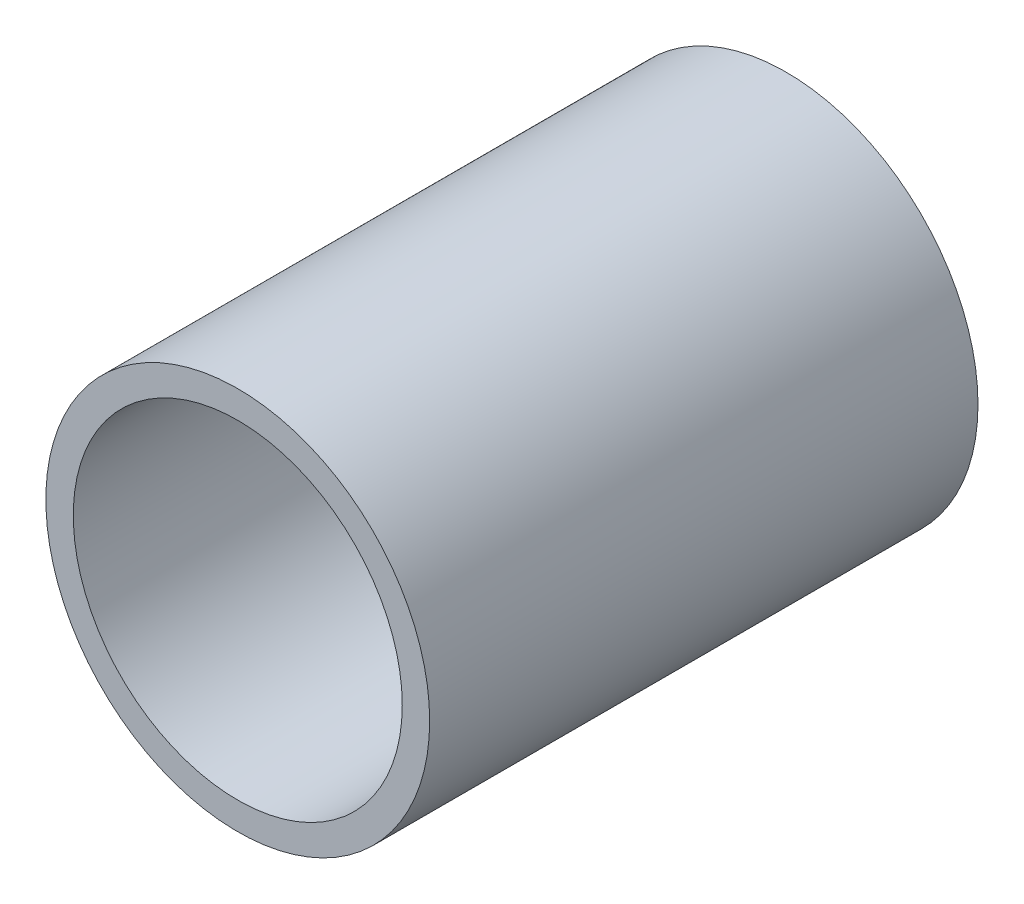
ISO-10303-21;
HEADER;
FILE_DESCRIPTION(('STEP AP214'),'2;1');
FILE_NAME('part.step','',(''),(''),'','','');
FILE_SCHEMA(('AUTOMOTIVE_DESIGN { 1 0 10303 214 1 1 1 1 }'));
ENDSEC;
DATA;
#1=APPLICATION_CONTEXT('core data for automotive mechanical design processes');
#2=APPLICATION_PROTOCOL_DEFINITION('international standard','automotive_design',2000,#1);
#3=PRODUCT_CONTEXT('',#1,'mechanical');
#4=PRODUCT('Part','Part','',(#3));
#5=PRODUCT_RELATED_PRODUCT_CATEGORY('part','',(#4));
#6=PRODUCT_DEFINITION_FORMATION('','',#4);
#7=PRODUCT_DEFINITION_CONTEXT('part definition',#1,'design');
#8=PRODUCT_DEFINITION('design','',#6,#7);
#9=PRODUCT_DEFINITION_SHAPE('','',#8);
#10=(LENGTH_UNIT() NAMED_UNIT(*) SI_UNIT(.MILLI.,.METRE.));
#11=(NAMED_UNIT(*) PLANE_ANGLE_UNIT() SI_UNIT($,.RADIAN.));
#12=(NAMED_UNIT(*) SI_UNIT($,.STERADIAN.) SOLID_ANGLE_UNIT());
#13=UNCERTAINTY_MEASURE_WITH_UNIT(LENGTH_MEASURE(1.E-05),#10,'distance_accuracy_value','');
#14=(GEOMETRIC_REPRESENTATION_CONTEXT(3) GLOBAL_UNCERTAINTY_ASSIGNED_CONTEXT((#13)) GLOBAL_UNIT_ASSIGNED_CONTEXT((#10,
#11,#12)) REPRESENTATION_CONTEXT('',''));
#15=CARTESIAN_POINT('',(0.,0.,0.));
#16=DIRECTION('',(0.,0.,1.));
#17=DIRECTION('',(1.,0.,0.));
#18=AXIS2_PLACEMENT_3D('',#15,#16,#17);
#19=CARTESIAN_POINT('',(0.,0.,200.));
#20=DIRECTION('',(0.,0.,1.));
#21=DIRECTION('',(1.,0.,0.));
#22=AXIS2_PLACEMENT_3D('',#19,#20,#21);
#23=PLANE('',#22);
#24=CARTESIAN_POINT('',(0.,0.,200.));
#25=DIRECTION('',(0.,0.,1.));
#26=DIRECTION('',(1.,0.,0.));
#27=AXIS2_PLACEMENT_3D('',#24,#25,#26);
#28=CIRCLE('',#27,70.);
#29=CARTESIAN_POINT('',(70.,0.,200.));
#30=VERTEX_POINT('',#29);
#31=EDGE_CURVE('E10',#30,#30,#28,.T.);
#32=ORIENTED_EDGE('',*,*,#31,.T.);
#33=EDGE_LOOP('',(#32));
#34=FACE_BOUND('',#33,.T.);
#35=CARTESIAN_POINT('',(0.,0.,200.));
#36=DIRECTION('',(0.,0.,1.));
#37=DIRECTION('',(1.,0.,0.));
#38=AXIS2_PLACEMENT_3D('',#35,#36,#37);
#39=CIRCLE('',#38,60.);
#40=CARTESIAN_POINT('',(60.,0.,200.));
#41=VERTEX_POINT('',#40);
#42=EDGE_CURVE('E42',#41,#41,#39,.T.);
#43=ORIENTED_EDGE('',*,*,#42,.F.);
#44=EDGE_LOOP('',(#43));
#45=FACE_BOUND('',#44,.T.);
#46=ADVANCED_FACE('F31',(#34,#45),#23,.T.);
#47=CARTESIAN_POINT('',(0.,0.,0.));
#48=DIRECTION('',(0.,0.,1.));
#49=DIRECTION('',(1.,0.,0.));
#50=AXIS2_PLACEMENT_3D('',#47,#48,#49);
#51=PLANE('',#50);
#52=CARTESIAN_POINT('',(0.,0.,0.));
#53=DIRECTION('',(0.,0.,1.));
#54=DIRECTION('',(1.,0.,0.));
#55=AXIS2_PLACEMENT_3D('',#52,#53,#54);
#56=CIRCLE('',#55,70.);
#57=CARTESIAN_POINT('',(70.,0.,0.));
#58=VERTEX_POINT('',#57);
#59=EDGE_CURVE('E35',#58,#58,#56,.T.);
#60=ORIENTED_EDGE('',*,*,#59,.F.);
#61=EDGE_LOOP('',(#60));
#62=FACE_BOUND('',#61,.T.);
#63=CARTESIAN_POINT('',(0.,0.,0.));
#64=DIRECTION('',(0.,0.,1.));
#65=DIRECTION('',(1.,0.,0.));
#66=AXIS2_PLACEMENT_3D('',#63,#64,#65);
#67=CIRCLE('',#66,60.);
#68=CARTESIAN_POINT('',(60.,0.,0.));
#69=VERTEX_POINT('',#68);
#70=EDGE_CURVE('E44',#69,#69,#67,.T.);
#71=ORIENTED_EDGE('',*,*,#70,.T.);
#72=EDGE_LOOP('',(#71));
#73=FACE_BOUND('',#72,.T.);
#74=ADVANCED_FACE('F54',(#62,#73),#51,.F.);
#75=CARTESIAN_POINT('',(0.,0.,200.));
#76=DIRECTION('',(0.,0.,-1.));
#77=DIRECTION('',(-1.,0.,0.));
#78=AXIS2_PLACEMENT_3D('',#75,#76,#77);
#79=CYLINDRICAL_SURFACE('',#78,70.);
#80=ORIENTED_EDGE('',*,*,#31,.F.);
#81=EDGE_LOOP('',(#80));
#82=FACE_BOUND('',#81,.T.);
#83=ORIENTED_EDGE('',*,*,#59,.T.);
#84=EDGE_LOOP('',(#83));
#85=FACE_BOUND('',#84,.T.);
#86=ADVANCED_FACE('F33',(#82,#85),#79,.T.);
#87=CARTESIAN_POINT('',(0.,0.,200.));
#88=DIRECTION('',(0.,0.,-1.));
#89=DIRECTION('',(-1.,0.,0.));
#90=AXIS2_PLACEMENT_3D('',#87,#88,#89);
#91=CYLINDRICAL_SURFACE('',#90,60.);
#92=ORIENTED_EDGE('',*,*,#42,.T.);
#93=EDGE_LOOP('',(#92));
#94=FACE_BOUND('',#93,.T.);
#95=ORIENTED_EDGE('',*,*,#70,.F.);
#96=EDGE_LOOP('',(#95));
#97=FACE_BOUND('',#96,.T.);
#98=ADVANCED_FACE('F50',(#94,#97),#91,.F.);
#99=CLOSED_SHELL('',(#46,#74,#86,#98));
#100=MANIFOLD_SOLID_BREP('B2',#99);
#101=ADVANCED_BREP_SHAPE_REPRESENTATION('',(#18,#100),#14);
#102=SHAPE_DEFINITION_REPRESENTATION(#9,#101);
ENDSEC;
END-ISO-10303-21;
